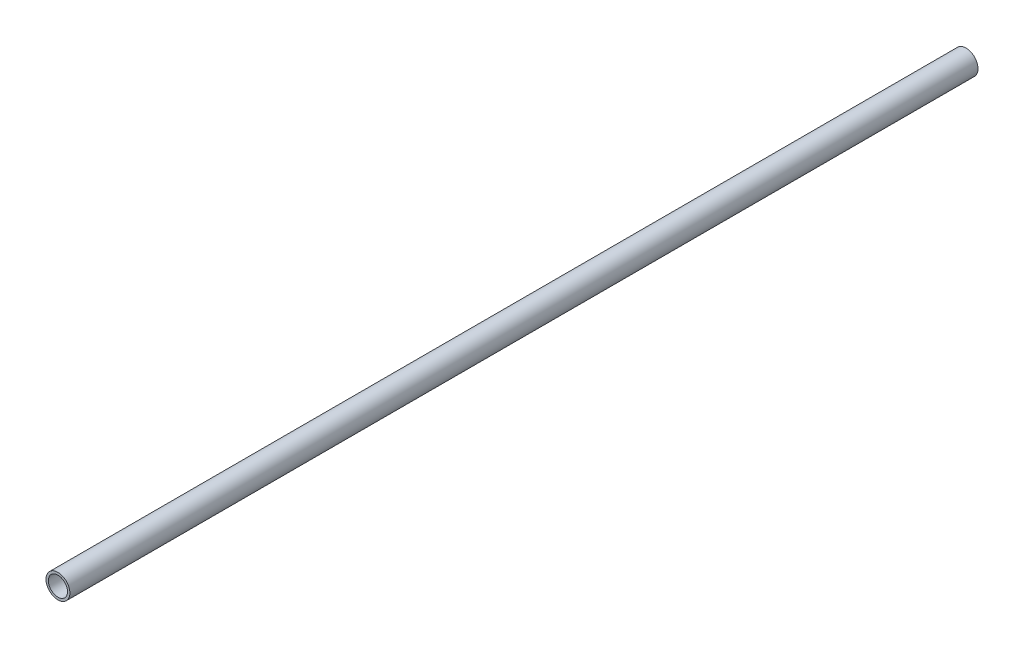
ISO-10303-21;
HEADER;
FILE_DESCRIPTION(('STEP AP214'),'2;1');
FILE_NAME('part.step','',(''),(''),'','','');
FILE_SCHEMA(('AUTOMOTIVE_DESIGN { 1 0 10303 214 1 1 1 1 }'));
ENDSEC;
DATA;
#1=APPLICATION_CONTEXT('core data for automotive mechanical design processes');
#2=APPLICATION_PROTOCOL_DEFINITION('international standard','automotive_design',2000,#1);
#3=PRODUCT_CONTEXT('',#1,'mechanical');
#4=PRODUCT('Part','Part','',(#3));
#5=PRODUCT_RELATED_PRODUCT_CATEGORY('part','',(#4));
#6=PRODUCT_DEFINITION_FORMATION('','',#4);
#7=PRODUCT_DEFINITION_CONTEXT('part definition',#1,'design');
#8=PRODUCT_DEFINITION('design','',#6,#7);
#9=PRODUCT_DEFINITION_SHAPE('','',#8);
#10=(LENGTH_UNIT() NAMED_UNIT(*) SI_UNIT(.MILLI.,.METRE.));
#11=(NAMED_UNIT(*) PLANE_ANGLE_UNIT() SI_UNIT($,.RADIAN.));
#12=(NAMED_UNIT(*) SI_UNIT($,.STERADIAN.) SOLID_ANGLE_UNIT());
#13=UNCERTAINTY_MEASURE_WITH_UNIT(LENGTH_MEASURE(1.E-05),#10,'distance_accuracy_value','');
#14=(GEOMETRIC_REPRESENTATION_CONTEXT(3) GLOBAL_UNCERTAINTY_ASSIGNED_CONTEXT((#13)) GLOBAL_UNIT_ASSIGNED_CONTEXT((#10,
#11,#12)) REPRESENTATION_CONTEXT('',''));
#15=CARTESIAN_POINT('',(0.,0.,0.));
#16=DIRECTION('',(0.,0.,1.));
#17=DIRECTION('',(1.,0.,0.));
#18=AXIS2_PLACEMENT_3D('',#15,#16,#17);
#19=CARTESIAN_POINT('',(0.,0.,380.));
#20=DIRECTION('',(0.,0.,1.));
#21=DIRECTION('',(1.,0.,0.));
#22=AXIS2_PLACEMENT_3D('',#19,#20,#21);
#23=PLANE('',#22);
#24=CARTESIAN_POINT('',(0.,0.,380.));
#25=DIRECTION('',(0.,0.,1.));
#26=DIRECTION('',(1.,0.,0.));
#27=AXIS2_PLACEMENT_3D('',#24,#25,#26);
#28=CIRCLE('',#27,5.);
#29=CARTESIAN_POINT('',(5.,0.,380.));
#30=VERTEX_POINT('',#29);
#31=EDGE_CURVE('E10',#30,#30,#28,.T.);
#32=ORIENTED_EDGE('',*,*,#31,.T.);
#33=EDGE_LOOP('',(#32));
#34=FACE_BOUND('',#33,.T.);
#35=CARTESIAN_POINT('',(0.,0.,380.));
#36=DIRECTION('',(0.,0.,1.));
#37=DIRECTION('',(1.,0.,0.));
#38=AXIS2_PLACEMENT_3D('',#35,#36,#37);
#39=CIRCLE('',#38,4.);
#40=CARTESIAN_POINT('',(4.,0.,380.));
#41=VERTEX_POINT('',#40);
#42=EDGE_CURVE('E44',#41,#41,#39,.T.);
#43=ORIENTED_EDGE('',*,*,#42,.F.);
#44=EDGE_LOOP('',(#43));
#45=FACE_BOUND('',#44,.T.);
#46=ADVANCED_FACE('F33',(#34,#45),#23,.T.);
#47=CARTESIAN_POINT('',(0.,0.,0.));
#48=DIRECTION('',(0.,0.,1.));
#49=DIRECTION('',(1.,0.,0.));
#50=AXIS2_PLACEMENT_3D('',#47,#48,#49);
#51=PLANE('',#50);
#52=CARTESIAN_POINT('',(0.,0.,0.));
#53=DIRECTION('',(0.,0.,1.));
#54=DIRECTION('',(1.,0.,0.));
#55=AXIS2_PLACEMENT_3D('',#52,#53,#54);
#56=CIRCLE('',#55,5.);
#57=CARTESIAN_POINT('',(5.,0.,0.));
#58=VERTEX_POINT('',#57);
#59=EDGE_CURVE('E37',#58,#58,#56,.T.);
#60=ORIENTED_EDGE('',*,*,#59,.F.);
#61=EDGE_LOOP('',(#60));
#62=FACE_BOUND('',#61,.T.);
#63=CARTESIAN_POINT('',(0.,0.,0.));
#64=DIRECTION('',(0.,0.,1.));
#65=DIRECTION('',(1.,0.,0.));
#66=AXIS2_PLACEMENT_3D('',#63,#64,#65);
#67=CIRCLE('',#66,4.);
#68=CARTESIAN_POINT('',(4.,0.,0.));
#69=VERTEX_POINT('',#68);
#70=EDGE_CURVE('E46',#69,#69,#67,.T.);
#71=ORIENTED_EDGE('',*,*,#70,.T.);
#72=EDGE_LOOP('',(#71));
#73=FACE_BOUND('',#72,.T.);
#74=ADVANCED_FACE('F56',(#62,#73),#51,.F.);
#75=CARTESIAN_POINT('',(0.,0.,380.));
#76=DIRECTION('',(0.,0.,-1.));
#77=DIRECTION('',(-1.,0.,0.));
#78=AXIS2_PLACEMENT_3D('',#75,#76,#77);
#79=CYLINDRICAL_SURFACE('',#78,5.);
#80=ORIENTED_EDGE('',*,*,#31,.F.);
#81=EDGE_LOOP('',(#80));
#82=FACE_BOUND('',#81,.T.);
#83=ORIENTED_EDGE('',*,*,#59,.T.);
#84=EDGE_LOOP('',(#83));
#85=FACE_BOUND('',#84,.T.);
#86=ADVANCED_FACE('F35',(#82,#85),#79,.T.);
#87=CARTESIAN_POINT('',(0.,0.,380.));
#88=DIRECTION('',(0.,0.,-1.));
#89=DIRECTION('',(-1.,0.,0.));
#90=AXIS2_PLACEMENT_3D('',#87,#88,#89);
#91=CYLINDRICAL_SURFACE('',#90,4.);
#92=ORIENTED_EDGE('',*,*,#42,.T.);
#93=EDGE_LOOP('',(#92));
#94=FACE_BOUND('',#93,.T.);
#95=ORIENTED_EDGE('',*,*,#70,.F.);
#96=EDGE_LOOP('',(#95));
#97=FACE_BOUND('',#96,.T.);
#98=ADVANCED_FACE('F52',(#94,#97),#91,.F.);
#99=CLOSED_SHELL('',(#46,#74,#86,#98));
#100=MANIFOLD_SOLID_BREP('B2',#99);
#101=ADVANCED_BREP_SHAPE_REPRESENTATION('',(#18,#100),#14);
#102=SHAPE_DEFINITION_REPRESENTATION(#9,#101);
ENDSEC;
END-ISO-10303-21;
